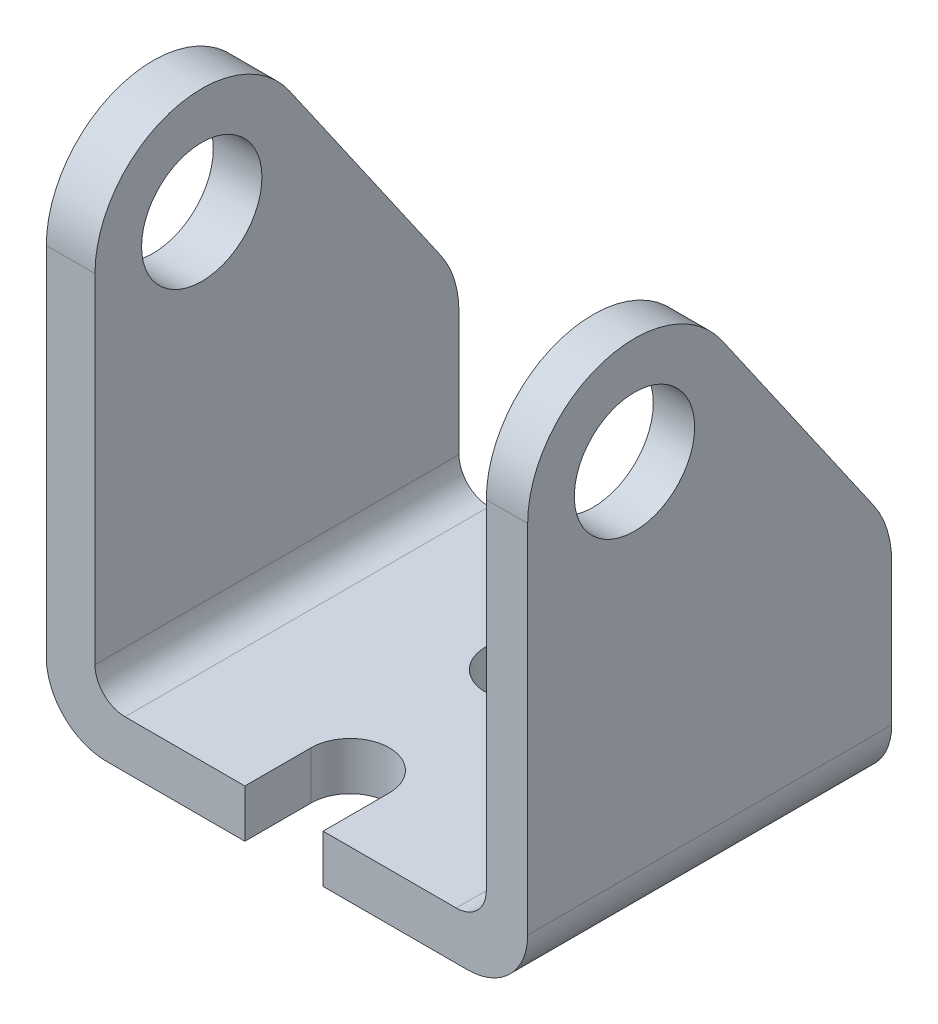
ISO-10303-21;
HEADER;
FILE_DESCRIPTION(('STEP AP214'),'2;1');
FILE_NAME('part.step','',(''),(''),'','','');
FILE_SCHEMA(('AUTOMOTIVE_DESIGN { 1 0 10303 214 1 1 1 1 }'));
ENDSEC;
DATA;
#1=APPLICATION_CONTEXT('core data for automotive mechanical design processes');
#2=APPLICATION_PROTOCOL_DEFINITION('international standard','automotive_design',2000,#1);
#3=PRODUCT_CONTEXT('',#1,'mechanical');
#4=PRODUCT('Part','Part','',(#3));
#5=PRODUCT_RELATED_PRODUCT_CATEGORY('part','',(#4));
#6=PRODUCT_DEFINITION_FORMATION('','',#4);
#7=PRODUCT_DEFINITION_CONTEXT('part definition',#1,'design');
#8=PRODUCT_DEFINITION('design','',#6,#7);
#9=PRODUCT_DEFINITION_SHAPE('','',#8);
#10=(LENGTH_UNIT() NAMED_UNIT(*) SI_UNIT(.MILLI.,.METRE.));
#11=(NAMED_UNIT(*) PLANE_ANGLE_UNIT() SI_UNIT($,.RADIAN.));
#12=(NAMED_UNIT(*) SI_UNIT($,.STERADIAN.) SOLID_ANGLE_UNIT());
#13=UNCERTAINTY_MEASURE_WITH_UNIT(LENGTH_MEASURE(1.E-05),#10,'distance_accuracy_value','');
#14=(GEOMETRIC_REPRESENTATION_CONTEXT(3) GLOBAL_UNCERTAINTY_ASSIGNED_CONTEXT((#13)) GLOBAL_UNIT_ASSIGNED_CONTEXT((#10,
#11,#12)) REPRESENTATION_CONTEXT('',''));
#15=CARTESIAN_POINT('',(0.,0.,0.));
#16=DIRECTION('',(0.,0.,1.));
#17=DIRECTION('',(1.,0.,0.));
#18=AXIS2_PLACEMENT_3D('',#15,#16,#17);
#19=CARTESIAN_POINT('',(0.,0.,30.734));
#20=DIRECTION('',(1.,0.,0.));
#21=DIRECTION('',(0.,0.,-1.));
#22=AXIS2_PLACEMENT_3D('',#19,#20,#21);
#23=PLANE('',#22);
#24=CARTESIAN_POINT('',(0.,35.179,21.717));
#25=DIRECTION('',(1.,0.,0.));
#26=DIRECTION('',(0.,0.,-1.));
#27=AXIS2_PLACEMENT_3D('',#24,#25,#26);
#28=CIRCLE('',#27,5.08);
#29=CARTESIAN_POINT('',(0.,35.179,16.637));
#30=VERTEX_POINT('',#29);
#31=EDGE_CURVE('E285',#30,#30,#28,.T.);
#32=ORIENTED_EDGE('',*,*,#31,.T.);
#33=EDGE_LOOP('',(#32));
#34=FACE_BOUND('',#33,.T.);
#35=CARTESIAN_POINT('',(0.,17.018,8.54585412950397));
#36=DIRECTION('',(-1.,0.,0.));
#37=DIRECTION('',(0.,0.,1.));
#38=AXIS2_PLACEMENT_3D('',#35,#36,#37);
#39=CIRCLE('',#38,8.54585412950397);
#40=CARTESIAN_POINT('',(0.,21.8888507867444,1.524));
#41=VERTEX_POINT('',#40);
#42=CARTESIAN_POINT('',(0.,17.018,0.));
#43=VERTEX_POINT('',#42);
#44=EDGE_CURVE('E250',#41,#43,#39,.T.);
#45=ORIENTED_EDGE('',*,*,#44,.T.);
#46=DIRECTION('',(0.,-1.,0.));
#47=VECTOR('',#46,1.);
#48=CARTESIAN_POINT('',(0.,0.,0.));
#49=LINE('',#48,#47);
#50=CARTESIAN_POINT('',(0.,5.08,0.));
#51=VERTEX_POINT('',#50);
#52=EDGE_CURVE('E210',#43,#51,#49,.T.);
#53=ORIENTED_EDGE('',*,*,#52,.T.);
#54=DIRECTION('',(0.,0.,-1.));
#55=VECTOR('',#54,1.);
#56=CARTESIAN_POINT('',(0.,5.08,30.734));
#57=LINE('',#56,#55);
#58=CARTESIAN_POINT('',(0.,5.08,30.734));
#59=VERTEX_POINT('',#58);
#60=EDGE_CURVE('E226',#51,#59,#57,.F.);
#61=ORIENTED_EDGE('',*,*,#60,.T.);
#62=DIRECTION('',(0.,-1.,0.));
#63=VECTOR('',#62,1.);
#64=CARTESIAN_POINT('',(0.,0.,30.734));
#65=LINE('',#64,#63);
#66=CARTESIAN_POINT('',(0.,35.179,30.734));
#67=VERTEX_POINT('',#66);
#68=EDGE_CURVE('E188',#67,#59,#65,.T.);
#69=ORIENTED_EDGE('',*,*,#68,.F.);
#70=CARTESIAN_POINT('',(0.,35.179,21.717));
#71=DIRECTION('',(-1.,0.,0.));
#72=DIRECTION('',(0.,0.,1.));
#73=AXIS2_PLACEMENT_3D('',#70,#71,#72);
#74=CIRCLE('',#73,9.017);
#75=CARTESIAN_POINT('',(0.,40.3183881616165,14.3080204262506));
#76=VERTEX_POINT('',#75);
#77=EDGE_CURVE('E56',#67,#76,#74,.T.);
#78=ORIENTED_EDGE('',*,*,#77,.T.);
#79=DIRECTION('',(0.,0.821667913247138,0.569966525631193));
#80=VECTOR('',#79,1.);
#81=CARTESIAN_POINT('',(0.,21.8888507867444,1.524));
#82=LINE('',#81,#80);
#83=EDGE_CURVE('E41',#76,#41,#82,.F.);
#84=ORIENTED_EDGE('',*,*,#83,.T.);
#85=EDGE_LOOP('',(#45,#53,#61,#69,#78,#84));
#86=FACE_BOUND('',#85,.T.);
#87=ADVANCED_FACE('F37',(#34,#86),#23,.F.);
#88=CARTESIAN_POINT('',(40.64,0.,30.734));
#89=DIRECTION('',(-1.,0.,0.));
#90=DIRECTION('',(0.,0.,1.));
#91=AXIS2_PLACEMENT_3D('',#88,#89,#90);
#92=PLANE('',#91);
#93=CARTESIAN_POINT('',(40.64,35.179,21.717));
#94=DIRECTION('',(1.,0.,0.));
#95=DIRECTION('',(0.,0.,-1.));
#96=AXIS2_PLACEMENT_3D('',#93,#94,#95);
#97=CIRCLE('',#96,5.08);
#98=CARTESIAN_POINT('',(40.64,35.179,16.637));
#99=VERTEX_POINT('',#98);
#100=EDGE_CURVE('E246',#99,#99,#97,.T.);
#101=ORIENTED_EDGE('',*,*,#100,.F.);
#102=EDGE_LOOP('',(#101));
#103=FACE_BOUND('',#102,.T.);
#104=CARTESIAN_POINT('',(40.64,17.018,8.54585412950397));
#105=DIRECTION('',(1.,0.,0.));
#106=DIRECTION('',(0.,0.,-1.));
#107=AXIS2_PLACEMENT_3D('',#104,#105,#106);
#108=CIRCLE('',#107,8.54585412950397);
#109=CARTESIAN_POINT('',(40.64,21.8888507867444,1.524));
#110=VERTEX_POINT('',#109);
#111=CARTESIAN_POINT('',(40.64,17.018,0.));
#112=VERTEX_POINT('',#111);
#113=EDGE_CURVE('E381',#110,#112,#108,.F.);
#114=ORIENTED_EDGE('',*,*,#113,.F.);
#115=DIRECTION('',(0.,-0.821667913247138,-0.569966525631193));
#116=VECTOR('',#115,1.);
#117=CARTESIAN_POINT('',(40.64,6.39712778396965,-9.22214621500566));
#118=LINE('',#117,#116);
#119=CARTESIAN_POINT('',(40.64,40.3183881616165,14.3080204262506));
#120=VERTEX_POINT('',#119);
#121=EDGE_CURVE('E383',#120,#110,#118,.T.);
#122=ORIENTED_EDGE('',*,*,#121,.F.);
#123=CARTESIAN_POINT('',(40.64,35.179,21.717));
#124=DIRECTION('',(1.,0.,0.));
#125=DIRECTION('',(0.,0.,-1.));
#126=AXIS2_PLACEMENT_3D('',#123,#124,#125);
#127=CIRCLE('',#126,9.017);
#128=CARTESIAN_POINT('',(40.64,35.179,30.734));
#129=VERTEX_POINT('',#128);
#130=EDGE_CURVE('E271',#129,#120,#127,.F.);
#131=ORIENTED_EDGE('',*,*,#130,.F.);
#132=DIRECTION('',(0.,1.,0.));
#133=VECTOR('',#132,1.);
#134=CARTESIAN_POINT('',(40.64,0.,30.734));
#135=LINE('',#134,#133);
#136=CARTESIAN_POINT('',(40.64,5.08,30.734));
#137=VERTEX_POINT('',#136);
#138=EDGE_CURVE('E310',#137,#129,#135,.T.);
#139=ORIENTED_EDGE('',*,*,#138,.F.);
#140=DIRECTION('',(0.,0.,-1.));
#141=VECTOR('',#140,1.);
#142=CARTESIAN_POINT('',(40.64,5.08,30.734));
#143=LINE('',#142,#141);
#144=CARTESIAN_POINT('',(40.64,5.08,0.));
#145=VERTEX_POINT('',#144);
#146=EDGE_CURVE('E206',#137,#145,#143,.T.);
#147=ORIENTED_EDGE('',*,*,#146,.T.);
#148=DIRECTION('',(0.,1.,0.));
#149=VECTOR('',#148,1.);
#150=CARTESIAN_POINT('',(40.64,0.,0.));
#151=LINE('',#150,#149);
#152=EDGE_CURVE('E323',#145,#112,#151,.T.);
#153=ORIENTED_EDGE('',*,*,#152,.T.);
#154=EDGE_LOOP('',(#114,#122,#131,#139,#147,#153));
#155=FACE_BOUND('',#154,.T.);
#156=ADVANCED_FACE('F363',(#103,#155),#92,.F.);
#157=CARTESIAN_POINT('',(37.1473412653673,44.196,30.734));
#158=DIRECTION('',(1.,0.,0.));
#159=DIRECTION('',(0.,0.,-1.));
#160=AXIS2_PLACEMENT_3D('',#157,#158,#159);
#161=PLANE('',#160);
#162=CARTESIAN_POINT('',(37.1473412653673,35.179,21.717));
#163=DIRECTION('',(1.,0.,0.));
#164=DIRECTION('',(0.,0.,-1.));
#165=AXIS2_PLACEMENT_3D('',#162,#163,#164);
#166=CIRCLE('',#165,5.08);
#167=CARTESIAN_POINT('',(37.1473412653673,35.179,16.637));
#168=VERTEX_POINT('',#167);
#169=EDGE_CURVE('E245',#168,#168,#166,.T.);
#170=ORIENTED_EDGE('',*,*,#169,.T.);
#171=EDGE_LOOP('',(#170));
#172=FACE_BOUND('',#171,.T.);
#173=CARTESIAN_POINT('',(37.1473412653673,17.018,8.54585412950397));
#174=DIRECTION('',(1.,0.,0.));
#175=DIRECTION('',(0.,0.,-1.));
#176=AXIS2_PLACEMENT_3D('',#173,#174,#175);
#177=CIRCLE('',#176,8.54585412950397);
#178=CARTESIAN_POINT('',(37.1473412653673,17.018,0.));
#179=VERTEX_POINT('',#178);
#180=CARTESIAN_POINT('',(37.1473412653673,21.8888507867444,1.524));
#181=VERTEX_POINT('',#180);
#182=EDGE_CURVE('E253',#179,#181,#177,.T.);
#183=ORIENTED_EDGE('',*,*,#182,.F.);
#184=DIRECTION('',(0.,-1.,0.));
#185=VECTOR('',#184,1.);
#186=CARTESIAN_POINT('',(37.1473412653673,44.196,0.));
#187=LINE('',#186,#185);
#188=CARTESIAN_POINT('',(37.1473412653673,6.58320685219459,0.));
#189=VERTEX_POINT('',#188);
#190=EDGE_CURVE('E193',#179,#189,#187,.T.);
#191=ORIENTED_EDGE('',*,*,#190,.T.);
#192=DIRECTION('',(0.,0.,-1.));
#193=VECTOR('',#192,1.);
#194=CARTESIAN_POINT('',(37.1473412653673,6.58320685219459,30.734));
#195=LINE('',#194,#193);
#196=CARTESIAN_POINT('',(37.1473412653673,6.58320685219459,30.734));
#197=VERTEX_POINT('',#196);
#198=EDGE_CURVE('E182',#189,#197,#195,.F.);
#199=ORIENTED_EDGE('',*,*,#198,.T.);
#200=DIRECTION('',(0.,-1.,0.));
#201=VECTOR('',#200,1.);
#202=CARTESIAN_POINT('',(37.1473412653673,44.196,30.734));
#203=LINE('',#202,#201);
#204=CARTESIAN_POINT('',(37.1473412653673,35.179,30.734));
#205=VERTEX_POINT('',#204);
#206=EDGE_CURVE('E313',#205,#197,#203,.T.);
#207=ORIENTED_EDGE('',*,*,#206,.F.);
#208=CARTESIAN_POINT('',(37.1473412653673,35.179,21.717));
#209=DIRECTION('',(1.,0.,0.));
#210=DIRECTION('',(0.,0.,-1.));
#211=AXIS2_PLACEMENT_3D('',#208,#209,#210);
#212=CIRCLE('',#211,9.017);
#213=CARTESIAN_POINT('',(37.1473412653673,40.3183881616165,14.3080204262506));
#214=VERTEX_POINT('',#213);
#215=EDGE_CURVE('E249',#214,#205,#212,.T.);
#216=ORIENTED_EDGE('',*,*,#215,.F.);
#217=DIRECTION('',(0.,0.821667913247138,0.569966525631193));
#218=VECTOR('',#217,1.);
#219=CARTESIAN_POINT('',(37.1473412653673,50.6289792933923,21.4601699867196));
#220=LINE('',#219,#218);
#221=EDGE_CURVE('E252',#181,#214,#220,.T.);
#222=ORIENTED_EDGE('',*,*,#221,.F.);
#223=EDGE_LOOP('',(#183,#191,#199,#207,#216,#222));
#224=FACE_BOUND('',#223,.T.);
#225=ADVANCED_FACE('F327',(#172,#224),#161,.F.);
#226=CARTESIAN_POINT('',(4.10723752433815,44.196,30.734));
#227=DIRECTION('',(-1.,0.,0.));
#228=DIRECTION('',(0.,0.,1.));
#229=AXIS2_PLACEMENT_3D('',#226,#227,#228);
#230=PLANE('',#229);
#231=CARTESIAN_POINT('',(4.10723752433815,35.179,21.717));
#232=DIRECTION('',(-1.,0.,0.));
#233=DIRECTION('',(0.,0.,1.));
#234=AXIS2_PLACEMENT_3D('',#231,#232,#233);
#235=CIRCLE('',#234,5.08);
#236=CARTESIAN_POINT('',(4.10723752433815,35.179,26.797));
#237=VERTEX_POINT('',#236);
#238=EDGE_CURVE('E242',#237,#237,#235,.T.);
#239=ORIENTED_EDGE('',*,*,#238,.T.);
#240=EDGE_LOOP('',(#239));
#241=FACE_BOUND('',#240,.T.);
#242=CARTESIAN_POINT('',(4.10723752433815,17.018,8.54585412950397));
#243=DIRECTION('',(-1.,0.,0.));
#244=DIRECTION('',(0.,0.,1.));
#245=AXIS2_PLACEMENT_3D('',#242,#243,#244);
#246=CIRCLE('',#245,8.54585412950397);
#247=CARTESIAN_POINT('',(4.10723752433815,21.8888507867444,1.524));
#248=VERTEX_POINT('',#247);
#249=CARTESIAN_POINT('',(4.10723752433815,17.018,0.));
#250=VERTEX_POINT('',#249);
#251=EDGE_CURVE('E258',#248,#250,#246,.T.);
#252=ORIENTED_EDGE('',*,*,#251,.F.);
#253=DIRECTION('',(0.,-0.821667913247138,-0.569966525631193));
#254=VECTOR('',#253,1.);
#255=CARTESIAN_POINT('',(4.10723752433815,50.6289792933923,21.4601699867196));
#256=LINE('',#255,#254);
#257=CARTESIAN_POINT('',(4.10723752433815,40.3183881616165,14.3080204262506));
#258=VERTEX_POINT('',#257);
#259=EDGE_CURVE('E11',#258,#248,#256,.T.);
#260=ORIENTED_EDGE('',*,*,#259,.F.);
#261=CARTESIAN_POINT('',(4.10723752433815,35.179,21.717));
#262=DIRECTION('',(-1.,0.,0.));
#263=DIRECTION('',(0.,0.,1.));
#264=AXIS2_PLACEMENT_3D('',#261,#262,#263);
#265=CIRCLE('',#264,9.017);
#266=CARTESIAN_POINT('',(4.10723752433815,35.179,30.734));
#267=VERTEX_POINT('',#266);
#268=EDGE_CURVE('E81',#267,#258,#265,.T.);
#269=ORIENTED_EDGE('',*,*,#268,.F.);
#270=DIRECTION('',(0.,1.,0.));
#271=VECTOR('',#270,1.);
#272=CARTESIAN_POINT('',(4.10723752433815,44.196,30.734));
#273=LINE('',#272,#271);
#274=CARTESIAN_POINT('',(4.10723752433815,6.58320685219459,30.734));
#275=VERTEX_POINT('',#274);
#276=EDGE_CURVE('E180',#275,#267,#273,.T.);
#277=ORIENTED_EDGE('',*,*,#276,.F.);
#278=DIRECTION('',(0.,0.,-1.));
#279=VECTOR('',#278,1.);
#280=CARTESIAN_POINT('',(4.10723752433815,6.58320685219459,0.));
#281=LINE('',#280,#279);
#282=CARTESIAN_POINT('',(4.10723752433815,6.58320685219459,0.));
#283=VERTEX_POINT('',#282);
#284=EDGE_CURVE('E163',#275,#283,#281,.T.);
#285=ORIENTED_EDGE('',*,*,#284,.T.);
#286=DIRECTION('',(0.,1.,0.));
#287=VECTOR('',#286,1.);
#288=CARTESIAN_POINT('',(4.10723752433815,44.196,0.));
#289=LINE('',#288,#287);
#290=EDGE_CURVE('E178',#283,#250,#289,.T.);
#291=ORIENTED_EDGE('',*,*,#290,.T.);
#292=EDGE_LOOP('',(#252,#260,#269,#277,#285,#291));
#293=FACE_BOUND('',#292,.T.);
#294=ADVANCED_FACE('F176',(#241,#293),#230,.F.);
#295=CARTESIAN_POINT('',(0.,0.,30.734));
#296=DIRECTION('',(0.,0.,-1.));
#297=DIRECTION('',(-1.,0.,0.));
#298=AXIS2_PLACEMENT_3D('',#295,#296,#297);
#299=PLANE('',#298);
#300=ORIENTED_EDGE('',*,*,#138,.T.);
#301=DIRECTION('',(-1.,0.,0.));
#302=VECTOR('',#301,1.);
#303=CARTESIAN_POINT('',(40.64,35.179,30.734));
#304=LINE('',#303,#302);
#305=EDGE_CURVE('E274',#129,#205,#304,.T.);
#306=ORIENTED_EDGE('',*,*,#305,.T.);
#307=ORIENTED_EDGE('',*,*,#206,.T.);
#308=CARTESIAN_POINT('',(34.6073412653673,6.58320685219459,30.734));
#309=DIRECTION('',(0.,0.,-1.));
#310=DIRECTION('',(-1.,0.,0.));
#311=AXIS2_PLACEMENT_3D('',#308,#309,#310);
#312=CIRCLE('',#311,2.54);
#313=CARTESIAN_POINT('',(34.6073412653673,4.04320685219459,30.734));
#314=VERTEX_POINT('',#313);
#315=EDGE_CURVE('E170',#197,#314,#312,.T.);
#316=ORIENTED_EDGE('',*,*,#315,.T.);
#317=DIRECTION('',(-1.,0.,0.));
#318=VECTOR('',#317,1.);
#319=CARTESIAN_POINT('',(4.10723752433815,4.04320685219459,30.734));
#320=LINE('',#319,#318);
#321=CARTESIAN_POINT('',(23.368,4.04320685219459,30.734));
#322=VERTEX_POINT('',#321);
#323=EDGE_CURVE('E316',#314,#322,#320,.T.);
#324=ORIENTED_EDGE('',*,*,#323,.T.);
#325=DIRECTION('',(0.,-1.,0.));
#326=VECTOR('',#325,1.);
#327=CARTESIAN_POINT('',(23.368,0.,30.734));
#328=LINE('',#327,#326);
#329=CARTESIAN_POINT('',(23.368,0.,30.734));
#330=VERTEX_POINT('',#329);
#331=EDGE_CURVE('E200',#322,#330,#328,.T.);
#332=ORIENTED_EDGE('',*,*,#331,.T.);
#333=DIRECTION('',(1.,0.,0.));
#334=VECTOR('',#333,1.);
#335=CARTESIAN_POINT('',(0.,0.,30.734));
#336=LINE('',#335,#334);
#337=CARTESIAN_POINT('',(35.56,0.,30.734));
#338=VERTEX_POINT('',#337);
#339=EDGE_CURVE('E191',#330,#338,#336,.T.);
#340=ORIENTED_EDGE('',*,*,#339,.T.);
#341=CARTESIAN_POINT('',(35.56,5.08,30.734));
#342=DIRECTION('',(0.,0.,-1.));
#343=DIRECTION('',(-1.,0.,0.));
#344=AXIS2_PLACEMENT_3D('',#341,#342,#343);
#345=CIRCLE('',#344,5.08);
#346=EDGE_CURVE('E224',#338,#137,#345,.F.);
#347=ORIENTED_EDGE('',*,*,#346,.T.);
#348=EDGE_LOOP('',(#300,#306,#307,#316,#324,#332,#340,#347));
#349=FACE_BOUND('',#348,.T.);
#350=ADVANCED_FACE('F337',(#349),#299,.F.);
#351=CARTESIAN_POINT('',(0.,0.,30.734));
#352=DIRECTION('',(0.,1.,0.));
#353=DIRECTION('',(0.,0.,1.));
#354=AXIS2_PLACEMENT_3D('',#351,#352,#353);
#355=PLANE('',#354);
#356=CARTESIAN_POINT('',(20.066,0.,10.414));
#357=DIRECTION('',(0.,-1.,0.));
#358=DIRECTION('',(0.,0.,-1.));
#359=AXIS2_PLACEMENT_3D('',#356,#357,#358);
#360=CIRCLE('',#359,3.302);
#361=CARTESIAN_POINT('',(20.066,0.,7.112));
#362=VERTEX_POINT('',#361);
#363=EDGE_CURVE('E289',#362,#362,#360,.T.);
#364=ORIENTED_EDGE('',*,*,#363,.F.);
#365=EDGE_LOOP('',(#364));
#366=FACE_BOUND('',#365,.T.);
#367=DIRECTION('',(1.,0.,0.));
#368=VECTOR('',#367,1.);
#369=CARTESIAN_POINT('',(0.,0.,0.));
#370=LINE('',#369,#368);
#371=CARTESIAN_POINT('',(5.08,0.,0.));
#372=VERTEX_POINT('',#371);
#373=CARTESIAN_POINT('',(35.56,0.,0.));
#374=VERTEX_POINT('',#373);
#375=EDGE_CURVE('E320',#372,#374,#370,.T.);
#376=ORIENTED_EDGE('',*,*,#375,.T.);
#377=DIRECTION('',(0.,0.,-1.));
#378=VECTOR('',#377,1.);
#379=CARTESIAN_POINT('',(35.56,0.,30.734));
#380=LINE('',#379,#378);
#381=EDGE_CURVE('E222',#374,#338,#380,.F.);
#382=ORIENTED_EDGE('',*,*,#381,.T.);
#383=ORIENTED_EDGE('',*,*,#339,.F.);
#384=DIRECTION('',(0.,0.,1.));
#385=VECTOR('',#384,1.);
#386=CARTESIAN_POINT('',(23.368,0.,30.734));
#387=LINE('',#386,#385);
#388=CARTESIAN_POINT('',(23.368,0.,25.146));
#389=VERTEX_POINT('',#388);
#390=EDGE_CURVE('E288',#389,#330,#387,.T.);
#391=ORIENTED_EDGE('',*,*,#390,.F.);
#392=CARTESIAN_POINT('',(20.066,0.,25.146));
#393=DIRECTION('',(0.,-1.,0.));
#394=DIRECTION('',(0.,0.,1.));
#395=AXIS2_PLACEMENT_3D('',#392,#393,#394);
#396=CIRCLE('',#395,3.302);
#397=CARTESIAN_POINT('',(16.764,0.,25.146));
#398=VERTEX_POINT('',#397);
#399=EDGE_CURVE('E298',#398,#389,#396,.T.);
#400=ORIENTED_EDGE('',*,*,#399,.F.);
#401=DIRECTION('',(0.,0.,-1.));
#402=VECTOR('',#401,1.);
#403=CARTESIAN_POINT('',(16.764,0.,25.146));
#404=LINE('',#403,#402);
#405=CARTESIAN_POINT('',(16.764,0.,30.734));
#406=VERTEX_POINT('',#405);
#407=EDGE_CURVE('E295',#406,#398,#404,.T.);
#408=ORIENTED_EDGE('',*,*,#407,.F.);
#409=CARTESIAN_POINT('',(5.08,0.,30.734));
#410=VERTEX_POINT('',#409);
#411=EDGE_CURVE('E308',#410,#406,#336,.T.);
#412=ORIENTED_EDGE('',*,*,#411,.F.);
#413=DIRECTION('',(0.,0.,-1.));
#414=VECTOR('',#413,1.);
#415=CARTESIAN_POINT('',(5.08,0.,30.734));
#416=LINE('',#415,#414);
#417=EDGE_CURVE('E219',#410,#372,#416,.T.);
#418=ORIENTED_EDGE('',*,*,#417,.T.);
#419=EDGE_LOOP('',(#376,#382,#383,#391,#400,#408,#412,#418));
#420=FACE_BOUND('',#419,.T.);
#421=ADVANCED_FACE('F352',(#366,#420),#355,.F.);
#422=CARTESIAN_POINT('',(4.10723752433815,4.04320685219459,30.734));
#423=DIRECTION('',(0.,-1.,0.));
#424=DIRECTION('',(0.,0.,-1.));
#425=AXIS2_PLACEMENT_3D('',#422,#423,#424);
#426=PLANE('',#425);
#427=CARTESIAN_POINT('',(20.066,4.04320685219459,10.414));
#428=DIRECTION('',(0.,-1.,0.));
#429=DIRECTION('',(0.,0.,-1.));
#430=AXIS2_PLACEMENT_3D('',#427,#428,#429);
#431=CIRCLE('',#430,3.302);
#432=CARTESIAN_POINT('',(20.066,4.04320685219459,7.112));
#433=VERTEX_POINT('',#432);
#434=EDGE_CURVE('E207',#433,#433,#431,.T.);
#435=ORIENTED_EDGE('',*,*,#434,.T.);
#436=EDGE_LOOP('',(#435));
#437=FACE_BOUND('',#436,.T.);
#438=ORIENTED_EDGE('',*,*,#323,.F.);
#439=DIRECTION('',(0.,0.,-1.));
#440=VECTOR('',#439,1.);
#441=CARTESIAN_POINT('',(34.6073412653673,4.04320685219459,0.));
#442=LINE('',#441,#440);
#443=CARTESIAN_POINT('',(34.6073412653673,4.04320685219459,0.));
#444=VERTEX_POINT('',#443);
#445=EDGE_CURVE('E232',#314,#444,#442,.T.);
#446=ORIENTED_EDGE('',*,*,#445,.T.);
#447=DIRECTION('',(-1.,0.,0.));
#448=VECTOR('',#447,1.);
#449=CARTESIAN_POINT('',(4.10723752433815,4.04320685219459,0.));
#450=LINE('',#449,#448);
#451=CARTESIAN_POINT('',(6.64723752433815,4.04320685219459,0.));
#452=VERTEX_POINT('',#451);
#453=EDGE_CURVE('E189',#444,#452,#450,.T.);
#454=ORIENTED_EDGE('',*,*,#453,.T.);
#455=DIRECTION('',(0.,0.,-1.));
#456=VECTOR('',#455,1.);
#457=CARTESIAN_POINT('',(6.64723752433815,4.04320685219459,30.734));
#458=LINE('',#457,#456);
#459=CARTESIAN_POINT('',(6.64723752433815,4.04320685219459,30.734));
#460=VERTEX_POINT('',#459);
#461=EDGE_CURVE('E164',#452,#460,#458,.F.);
#462=ORIENTED_EDGE('',*,*,#461,.T.);
#463=CARTESIAN_POINT('',(16.764,4.04320685219459,30.734));
#464=VERTEX_POINT('',#463);
#465=EDGE_CURVE('E315',#464,#460,#320,.T.);
#466=ORIENTED_EDGE('',*,*,#465,.F.);
#467=DIRECTION('',(0.,0.,-1.));
#468=VECTOR('',#467,1.);
#469=CARTESIAN_POINT('',(16.764,4.04320685219459,30.734));
#470=LINE('',#469,#468);
#471=CARTESIAN_POINT('',(16.764,4.04320685219459,25.146));
#472=VERTEX_POINT('',#471);
#473=EDGE_CURVE('E292',#464,#472,#470,.T.);
#474=ORIENTED_EDGE('',*,*,#473,.T.);
#475=CARTESIAN_POINT('',(20.066,4.04320685219459,25.146));
#476=DIRECTION('',(0.,-1.,0.));
#477=DIRECTION('',(0.,0.,-1.));
#478=AXIS2_PLACEMENT_3D('',#475,#476,#477);
#479=CIRCLE('',#478,3.302);
#480=CARTESIAN_POINT('',(23.368,4.04320685219459,25.146));
#481=VERTEX_POINT('',#480);
#482=EDGE_CURVE('E203',#472,#481,#479,.T.);
#483=ORIENTED_EDGE('',*,*,#482,.T.);
#484=DIRECTION('',(0.,0.,1.));
#485=VECTOR('',#484,1.);
#486=CARTESIAN_POINT('',(23.368,4.04320685219459,30.734));
#487=LINE('',#486,#485);
#488=EDGE_CURVE('E211',#481,#322,#487,.T.);
#489=ORIENTED_EDGE('',*,*,#488,.T.);
#490=EDGE_LOOP('',(#438,#446,#454,#462,#466,#474,#483,#489));
#491=FACE_BOUND('',#490,.T.);
#492=ADVANCED_FACE('F340',(#437,#491),#426,.F.);
#493=ORIENTED_EDGE('',*,*,#276,.T.);
#494=DIRECTION('',(-1.,0.,0.));
#495=VECTOR('',#494,1.);
#496=CARTESIAN_POINT('',(40.64,35.179,30.734));
#497=LINE('',#496,#495);
#498=EDGE_CURVE('E241',#267,#67,#497,.T.);
#499=ORIENTED_EDGE('',*,*,#498,.T.);
#500=ORIENTED_EDGE('',*,*,#68,.T.);
#501=CARTESIAN_POINT('',(5.08,5.08,30.734));
#502=DIRECTION('',(0.,0.,-1.));
#503=DIRECTION('',(-1.,0.,0.));
#504=AXIS2_PLACEMENT_3D('',#501,#502,#503);
#505=CIRCLE('',#504,5.08);
#506=EDGE_CURVE('E229',#59,#410,#505,.F.);
#507=ORIENTED_EDGE('',*,*,#506,.T.);
#508=ORIENTED_EDGE('',*,*,#411,.T.);
#509=DIRECTION('',(0.,1.,0.));
#510=VECTOR('',#509,1.);
#511=CARTESIAN_POINT('',(16.764,0.,30.734));
#512=LINE('',#511,#510);
#513=EDGE_CURVE('E197',#406,#464,#512,.T.);
#514=ORIENTED_EDGE('',*,*,#513,.T.);
#515=ORIENTED_EDGE('',*,*,#465,.T.);
#516=CARTESIAN_POINT('',(6.64723752433815,6.58320685219459,30.734));
#517=DIRECTION('',(0.,0.,-1.));
#518=DIRECTION('',(-1.,0.,0.));
#519=AXIS2_PLACEMENT_3D('',#516,#517,#518);
#520=CIRCLE('',#519,2.54);
#521=EDGE_CURVE('E169',#460,#275,#520,.T.);
#522=ORIENTED_EDGE('',*,*,#521,.T.);
#523=EDGE_LOOP('',(#493,#499,#500,#507,#508,#514,#515,#522));
#524=FACE_BOUND('',#523,.T.);
#525=ADVANCED_FACE('F451',(#524),#299,.F.);
#526=CARTESIAN_POINT('',(0.,0.,0.));
#527=DIRECTION('',(0.,0.,-1.));
#528=DIRECTION('',(-1.,0.,0.));
#529=AXIS2_PLACEMENT_3D('',#526,#527,#528);
#530=PLANE('',#529);
#531=DIRECTION('',(-1.,0.,0.));
#532=VECTOR('',#531,1.);
#533=CARTESIAN_POINT('',(40.64,17.018,0.));
#534=LINE('',#533,#532);
#535=EDGE_CURVE('E367',#112,#179,#534,.T.);
#536=ORIENTED_EDGE('',*,*,#535,.F.);
#537=ORIENTED_EDGE('',*,*,#152,.F.);
#538=CARTESIAN_POINT('',(35.56,5.08,0.));
#539=DIRECTION('',(0.,0.,-1.));
#540=DIRECTION('',(-1.,0.,0.));
#541=AXIS2_PLACEMENT_3D('',#538,#539,#540);
#542=CIRCLE('',#541,5.08);
#543=EDGE_CURVE('E217',#145,#374,#542,.T.);
#544=ORIENTED_EDGE('',*,*,#543,.T.);
#545=ORIENTED_EDGE('',*,*,#375,.F.);
#546=CARTESIAN_POINT('',(5.08,5.08,0.));
#547=DIRECTION('',(0.,0.,-1.));
#548=DIRECTION('',(-1.,0.,0.));
#549=AXIS2_PLACEMENT_3D('',#546,#547,#548);
#550=CIRCLE('',#549,5.08);
#551=EDGE_CURVE('E214',#372,#51,#550,.T.);
#552=ORIENTED_EDGE('',*,*,#551,.T.);
#553=ORIENTED_EDGE('',*,*,#52,.F.);
#554=DIRECTION('',(-1.,0.,0.));
#555=VECTOR('',#554,1.);
#556=CARTESIAN_POINT('',(40.64,17.018,0.));
#557=LINE('',#556,#555);
#558=EDGE_CURVE('E47',#250,#43,#557,.T.);
#559=ORIENTED_EDGE('',*,*,#558,.F.);
#560=ORIENTED_EDGE('',*,*,#290,.F.);
#561=CARTESIAN_POINT('',(6.64723752433815,6.58320685219459,0.));
#562=DIRECTION('',(0.,0.,-1.));
#563=DIRECTION('',(-1.,0.,0.));
#564=AXIS2_PLACEMENT_3D('',#561,#562,#563);
#565=CIRCLE('',#564,2.54);
#566=EDGE_CURVE('E160',#283,#452,#565,.F.);
#567=ORIENTED_EDGE('',*,*,#566,.T.);
#568=ORIENTED_EDGE('',*,*,#453,.F.);
#569=CARTESIAN_POINT('',(34.6073412653673,6.58320685219459,0.));
#570=DIRECTION('',(0.,0.,-1.));
#571=DIRECTION('',(-1.,0.,0.));
#572=AXIS2_PLACEMENT_3D('',#569,#570,#571);
#573=CIRCLE('',#572,2.54);
#574=EDGE_CURVE('E181',#444,#189,#573,.F.);
#575=ORIENTED_EDGE('',*,*,#574,.T.);
#576=ORIENTED_EDGE('',*,*,#190,.F.);
#577=EDGE_LOOP('',(#536,#537,#544,#545,#552,#553,#559,#560,#567,#568,#575,#576));
#578=FACE_BOUND('',#577,.T.);
#579=ADVANCED_FACE('F186',(#578),#530,.T.);
#580=CARTESIAN_POINT('',(20.066,44.196,25.146));
#581=DIRECTION('',(0.,-1.,0.));
#582=DIRECTION('',(0.,0.,-1.));
#583=AXIS2_PLACEMENT_3D('',#580,#581,#582);
#584=CYLINDRICAL_SURFACE('',#583,3.302);
#585=DIRECTION('',(0.,-1.,0.));
#586=VECTOR('',#585,1.);
#587=CARTESIAN_POINT('',(16.764,44.196,25.146));
#588=LINE('',#587,#586);
#589=EDGE_CURVE('E301',#472,#398,#588,.T.);
#590=ORIENTED_EDGE('',*,*,#589,.T.);
#591=ORIENTED_EDGE('',*,*,#399,.T.);
#592=DIRECTION('',(0.,-1.,0.));
#593=VECTOR('',#592,1.);
#594=CARTESIAN_POINT('',(23.368,44.196,25.146));
#595=LINE('',#594,#593);
#596=EDGE_CURVE('E293',#481,#389,#595,.T.);
#597=ORIENTED_EDGE('',*,*,#596,.F.);
#598=ORIENTED_EDGE('',*,*,#482,.F.);
#599=EDGE_LOOP('',(#590,#591,#597,#598));
#600=FACE_BOUND('',#599,.T.);
#601=ADVANCED_FACE('F345',(#600),#584,.F.);
#602=CARTESIAN_POINT('',(23.368,44.196,30.734));
#603=DIRECTION('',(1.,0.,0.));
#604=DIRECTION('',(0.,0.,-1.));
#605=AXIS2_PLACEMENT_3D('',#602,#603,#604);
#606=PLANE('',#605);
#607=ORIENTED_EDGE('',*,*,#596,.T.);
#608=ORIENTED_EDGE('',*,*,#390,.T.);
#609=ORIENTED_EDGE('',*,*,#331,.F.);
#610=ORIENTED_EDGE('',*,*,#488,.F.);
#611=EDGE_LOOP('',(#607,#608,#609,#610));
#612=FACE_BOUND('',#611,.T.);
#613=ADVANCED_FACE('F343',(#612),#606,.F.);
#614=CARTESIAN_POINT('',(16.764,44.196,25.146));
#615=DIRECTION('',(-1.,0.,0.));
#616=DIRECTION('',(0.,0.,1.));
#617=AXIS2_PLACEMENT_3D('',#614,#615,#616);
#618=PLANE('',#617);
#619=ORIENTED_EDGE('',*,*,#513,.F.);
#620=ORIENTED_EDGE('',*,*,#407,.T.);
#621=ORIENTED_EDGE('',*,*,#589,.F.);
#622=ORIENTED_EDGE('',*,*,#473,.F.);
#623=EDGE_LOOP('',(#619,#620,#621,#622));
#624=FACE_BOUND('',#623,.T.);
#625=ADVANCED_FACE('F442',(#624),#618,.F.);
#626=CARTESIAN_POINT('',(20.066,44.196,10.414));
#627=DIRECTION('',(0.,-1.,0.));
#628=DIRECTION('',(0.,0.,-1.));
#629=AXIS2_PLACEMENT_3D('',#626,#627,#628);
#630=CYLINDRICAL_SURFACE('',#629,3.302);
#631=ORIENTED_EDGE('',*,*,#363,.T.);
#632=EDGE_LOOP('',(#631));
#633=FACE_BOUND('',#632,.T.);
#634=ORIENTED_EDGE('',*,*,#434,.F.);
#635=EDGE_LOOP('',(#634));
#636=FACE_BOUND('',#635,.T.);
#637=ADVANCED_FACE('F419',(#633,#636),#630,.F.);
#638=CARTESIAN_POINT('',(35.56,5.08,30.734));
#639=DIRECTION('',(0.,0.,-1.));
#640=DIRECTION('',(-1.,0.,0.));
#641=AXIS2_PLACEMENT_3D('',#638,#639,#640);
#642=CYLINDRICAL_SURFACE('',#641,5.08);
#643=ORIENTED_EDGE('',*,*,#346,.F.);
#644=ORIENTED_EDGE('',*,*,#381,.F.);
#645=ORIENTED_EDGE('',*,*,#543,.F.);
#646=ORIENTED_EDGE('',*,*,#146,.F.);
#647=EDGE_LOOP('',(#643,#644,#645,#646));
#648=FACE_BOUND('',#647,.T.);
#649=ADVANCED_FACE('F359',(#648),#642,.T.);
#650=CARTESIAN_POINT('',(5.08,5.08,30.734));
#651=DIRECTION('',(0.,0.,-1.));
#652=DIRECTION('',(-1.,0.,0.));
#653=AXIS2_PLACEMENT_3D('',#650,#651,#652);
#654=CYLINDRICAL_SURFACE('',#653,5.08);
#655=ORIENTED_EDGE('',*,*,#506,.F.);
#656=ORIENTED_EDGE('',*,*,#60,.F.);
#657=ORIENTED_EDGE('',*,*,#551,.F.);
#658=ORIENTED_EDGE('',*,*,#417,.F.);
#659=EDGE_LOOP('',(#655,#656,#657,#658));
#660=FACE_BOUND('',#659,.T.);
#661=ADVANCED_FACE('F418',(#660),#654,.T.);
#662=CARTESIAN_POINT('',(34.6073412653673,6.58320685219459,30.734));
#663=DIRECTION('',(0.,0.,1.));
#664=DIRECTION('',(1.,0.,0.));
#665=AXIS2_PLACEMENT_3D('',#662,#663,#664);
#666=CYLINDRICAL_SURFACE('',#665,2.54);
#667=ORIENTED_EDGE('',*,*,#315,.F.);
#668=ORIENTED_EDGE('',*,*,#198,.F.);
#669=ORIENTED_EDGE('',*,*,#574,.F.);
#670=ORIENTED_EDGE('',*,*,#445,.F.);
#671=EDGE_LOOP('',(#667,#668,#669,#670));
#672=FACE_BOUND('',#671,.T.);
#673=ADVANCED_FACE('F334',(#672),#666,.F.);
#674=CARTESIAN_POINT('',(6.64723752433815,6.58320685219459,30.734));
#675=DIRECTION('',(0.,0.,1.));
#676=DIRECTION('',(1.,0.,0.));
#677=AXIS2_PLACEMENT_3D('',#674,#675,#676);
#678=CYLINDRICAL_SURFACE('',#677,2.54);
#679=ORIENTED_EDGE('',*,*,#521,.F.);
#680=ORIENTED_EDGE('',*,*,#461,.F.);
#681=ORIENTED_EDGE('',*,*,#566,.F.);
#682=ORIENTED_EDGE('',*,*,#284,.F.);
#683=EDGE_LOOP('',(#679,#680,#681,#682));
#684=FACE_BOUND('',#683,.T.);
#685=ADVANCED_FACE('F39',(#684),#678,.F.);
#686=CARTESIAN_POINT('',(-1.2E-05,35.179,21.717));
#687=DIRECTION('',(1.,0.,0.));
#688=DIRECTION('',(0.,0.,-1.));
#689=AXIS2_PLACEMENT_3D('',#686,#687,#688);
#690=CYLINDRICAL_SURFACE('',#689,5.08);
#691=ORIENTED_EDGE('',*,*,#238,.F.);
#692=EDGE_LOOP('',(#691));
#693=FACE_BOUND('',#692,.T.);
#694=ORIENTED_EDGE('',*,*,#31,.F.);
#695=EDGE_LOOP('',(#694));
#696=FACE_BOUND('',#695,.T.);
#697=ADVANCED_FACE('F426',(#693,#696),#690,.F.);
#698=ORIENTED_EDGE('',*,*,#100,.T.);
#699=EDGE_LOOP('',(#698));
#700=FACE_BOUND('',#699,.T.);
#701=ORIENTED_EDGE('',*,*,#169,.F.);
#702=EDGE_LOOP('',(#701));
#703=FACE_BOUND('',#702,.T.);
#704=ADVANCED_FACE('F430',(#700,#703),#690,.F.);
#705=CARTESIAN_POINT('',(40.64,35.179,21.717));
#706=DIRECTION('',(-1.,0.,0.));
#707=DIRECTION('',(0.,0.,1.));
#708=AXIS2_PLACEMENT_3D('',#705,#706,#707);
#709=CYLINDRICAL_SURFACE('',#708,9.017);
#710=ORIENTED_EDGE('',*,*,#77,.F.);
#711=ORIENTED_EDGE('',*,*,#498,.F.);
#712=ORIENTED_EDGE('',*,*,#268,.T.);
#713=DIRECTION('',(-1.,0.,0.));
#714=VECTOR('',#713,1.);
#715=CARTESIAN_POINT('',(40.64,40.3183881616165,14.3080204262506));
#716=LINE('',#715,#714);
#717=EDGE_CURVE('E377',#258,#76,#716,.T.);
#718=ORIENTED_EDGE('',*,*,#717,.T.);
#719=EDGE_LOOP('',(#710,#711,#712,#718));
#720=FACE_BOUND('',#719,.T.);
#721=ADVANCED_FACE('F401',(#720),#709,.T.);
#722=ORIENTED_EDGE('',*,*,#215,.T.);
#723=ORIENTED_EDGE('',*,*,#305,.F.);
#724=ORIENTED_EDGE('',*,*,#130,.T.);
#725=EDGE_CURVE('E372',#120,#214,#716,.T.);
#726=ORIENTED_EDGE('',*,*,#725,.T.);
#727=EDGE_LOOP('',(#722,#723,#724,#726));
#728=FACE_BOUND('',#727,.T.);
#729=ADVANCED_FACE('F392',(#728),#709,.T.);
#730=CARTESIAN_POINT('',(40.64,17.018,8.54585412950397));
#731=DIRECTION('',(-1.,0.,0.));
#732=DIRECTION('',(0.,0.,1.));
#733=AXIS2_PLACEMENT_3D('',#730,#731,#732);
#734=CYLINDRICAL_SURFACE('',#733,8.54585412950397);
#735=ORIENTED_EDGE('',*,*,#182,.T.);
#736=DIRECTION('',(-1.,0.,0.));
#737=VECTOR('',#736,1.);
#738=CARTESIAN_POINT('',(40.64,21.8888507867444,1.524));
#739=LINE('',#738,#737);
#740=EDGE_CURVE('E267',#110,#181,#739,.T.);
#741=ORIENTED_EDGE('',*,*,#740,.F.);
#742=ORIENTED_EDGE('',*,*,#113,.T.);
#743=ORIENTED_EDGE('',*,*,#535,.T.);
#744=EDGE_LOOP('',(#735,#741,#742,#743));
#745=FACE_BOUND('',#744,.T.);
#746=ADVANCED_FACE('F390',(#745),#734,.T.);
#747=CARTESIAN_POINT('',(40.64,6.39712778396965,-9.22214621500566));
#748=DIRECTION('',(0.,0.569966525631193,-0.821667913247138));
#749=DIRECTION('',(0.,0.821667913247138,0.569966525631193));
#750=AXIS2_PLACEMENT_3D('',#747,#748,#749);
#751=PLANE('',#750);
#752=ORIENTED_EDGE('',*,*,#221,.T.);
#753=ORIENTED_EDGE('',*,*,#725,.F.);
#754=ORIENTED_EDGE('',*,*,#121,.T.);
#755=ORIENTED_EDGE('',*,*,#740,.T.);
#756=EDGE_LOOP('',(#752,#753,#754,#755));
#757=FACE_BOUND('',#756,.T.);
#758=ADVANCED_FACE('F388',(#757),#751,.T.);
#759=ORIENTED_EDGE('',*,*,#83,.F.);
#760=ORIENTED_EDGE('',*,*,#717,.F.);
#761=ORIENTED_EDGE('',*,*,#259,.T.);
#762=EDGE_CURVE('E371',#248,#41,#739,.T.);
#763=ORIENTED_EDGE('',*,*,#762,.T.);
#764=EDGE_LOOP('',(#759,#760,#761,#763));
#765=FACE_BOUND('',#764,.T.);
#766=ADVANCED_FACE('F399',(#765),#751,.T.);
#767=ORIENTED_EDGE('',*,*,#44,.F.);
#768=ORIENTED_EDGE('',*,*,#762,.F.);
#769=ORIENTED_EDGE('',*,*,#251,.T.);
#770=ORIENTED_EDGE('',*,*,#558,.T.);
#771=EDGE_LOOP('',(#767,#768,#769,#770));
#772=FACE_BOUND('',#771,.T.);
#773=ADVANCED_FACE('F394',(#772),#734,.T.);
#774=CLOSED_SHELL('',(#87,#156,#225,#294,#350,#421,#492,#525,#579,#601,#613,#625,#637,#649,#661,
#673,#685,#697,#704,#721,#729,#746,#758,#766,#773));
#775=MANIFOLD_SOLID_BREP('B2',#774);
#776=ADVANCED_BREP_SHAPE_REPRESENTATION('',(#18,#775),#14);
#777=SHAPE_DEFINITION_REPRESENTATION(#9,#776);
ENDSEC;
END-ISO-10303-21;
